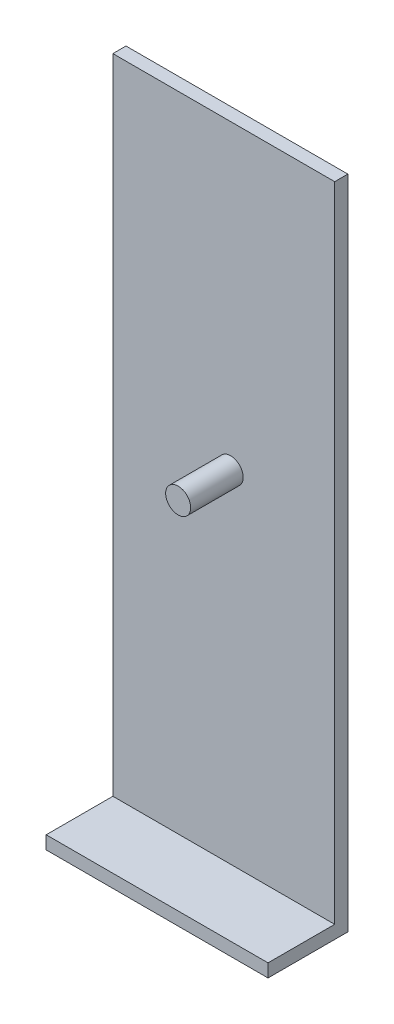
ISO-10303-21;
HEADER;
FILE_DESCRIPTION(('STEP AP214'),'2;1');
FILE_NAME('part.step','',(''),(''),'','','');
FILE_SCHEMA(('AUTOMOTIVE_DESIGN { 1 0 10303 214 1 1 1 1 }'));
ENDSEC;
DATA;
#1=APPLICATION_CONTEXT('core data for automotive mechanical design processes');
#2=APPLICATION_PROTOCOL_DEFINITION('international standard','automotive_design',2000,#1);
#3=PRODUCT_CONTEXT('',#1,'mechanical');
#4=PRODUCT('Part','Part','',(#3));
#5=PRODUCT_RELATED_PRODUCT_CATEGORY('part','',(#4));
#6=PRODUCT_DEFINITION_FORMATION('','',#4);
#7=PRODUCT_DEFINITION_CONTEXT('part definition',#1,'design');
#8=PRODUCT_DEFINITION('design','',#6,#7);
#9=PRODUCT_DEFINITION_SHAPE('','',#8);
#10=(LENGTH_UNIT() NAMED_UNIT(*) SI_UNIT(.MILLI.,.METRE.));
#11=(NAMED_UNIT(*) PLANE_ANGLE_UNIT() SI_UNIT($,.RADIAN.));
#12=(NAMED_UNIT(*) SI_UNIT($,.STERADIAN.) SOLID_ANGLE_UNIT());
#13=UNCERTAINTY_MEASURE_WITH_UNIT(LENGTH_MEASURE(1.E-05),#10,'distance_accuracy_value','');
#14=(GEOMETRIC_REPRESENTATION_CONTEXT(3) GLOBAL_UNCERTAINTY_ASSIGNED_CONTEXT((#13)) GLOBAL_UNIT_ASSIGNED_CONTEXT((#10,
#11,#12)) REPRESENTATION_CONTEXT('',''));
#15=CARTESIAN_POINT('',(0.,0.,0.));
#16=DIRECTION('',(0.,0.,1.));
#17=DIRECTION('',(1.,0.,0.));
#18=AXIS2_PLACEMENT_3D('',#15,#16,#17);
#19=CARTESIAN_POINT('',(0.,0.,5.));
#20=DIRECTION('',(0.,0.,-1.));
#21=DIRECTION('',(-1.,0.,0.));
#22=AXIS2_PLACEMENT_3D('',#19,#20,#21);
#23=PLANE('',#22);
#24=CARTESIAN_POINT('',(2.625,10.,5.));
#25=DIRECTION('',(0.,0.,-1.));
#26=DIRECTION('',(-1.,0.,0.));
#27=AXIS2_PLACEMENT_3D('',#24,#25,#26);
#28=CIRCLE('',#27,4.76250000000001);
#29=CARTESIAN_POINT('',(-2.13750000000001,10.,5.));
#30=VERTEX_POINT('',#29);
#31=EDGE_CURVE('E11',#30,#30,#28,.F.);
#32=ORIENTED_EDGE('',*,*,#31,.F.);
#33=EDGE_LOOP('',(#32));
#34=FACE_BOUND('',#33,.T.);
#35=DIRECTION('',(-1.,0.,0.));
#36=VECTOR('',#35,1.);
#37=CARTESIAN_POINT('',(-42.25,-120.,5.));
#38=LINE('',#37,#36);
#39=CARTESIAN_POINT('',(42.25,-120.,5.));
#40=VERTEX_POINT('',#39);
#41=CARTESIAN_POINT('',(-42.25,-120.,5.));
#42=VERTEX_POINT('',#41);
#43=EDGE_CURVE('E55',#40,#42,#38,.T.);
#44=ORIENTED_EDGE('',*,*,#43,.F.);
#45=DIRECTION('',(0.,1.,0.));
#46=VECTOR('',#45,1.);
#47=CARTESIAN_POINT('',(42.25,-125.,5.));
#48=LINE('',#47,#46);
#49=CARTESIAN_POINT('',(42.25,125.,5.));
#50=VERTEX_POINT('',#49);
#51=EDGE_CURVE('E60',#40,#50,#48,.T.);
#52=ORIENTED_EDGE('',*,*,#51,.T.);
#53=DIRECTION('',(1.,0.,0.));
#54=VECTOR('',#53,1.);
#55=CARTESIAN_POINT('',(-42.25,125.,5.));
#56=LINE('',#55,#54);
#57=CARTESIAN_POINT('',(-42.25,125.,5.));
#58=VERTEX_POINT('',#57);
#59=EDGE_CURVE('E130',#58,#50,#56,.T.);
#60=ORIENTED_EDGE('',*,*,#59,.F.);
#61=DIRECTION('',(0.,1.,0.));
#62=VECTOR('',#61,1.);
#63=CARTESIAN_POINT('',(-42.25,-125.,5.));
#64=LINE('',#63,#62);
#65=EDGE_CURVE('E104',#42,#58,#64,.T.);
#66=ORIENTED_EDGE('',*,*,#65,.F.);
#67=EDGE_LOOP('',(#44,#52,#60,#66));
#68=FACE_BOUND('',#67,.T.);
#69=ADVANCED_FACE('F39',(#34,#68),#23,.F.);
#70=CARTESIAN_POINT('',(-42.25,-125.,5.));
#71=DIRECTION('',(-1.,0.,0.));
#72=DIRECTION('',(0.,0.,1.));
#73=AXIS2_PLACEMENT_3D('',#70,#71,#72);
#74=PLANE('',#73);
#75=DIRECTION('',(0.,1.,0.));
#76=VECTOR('',#75,1.);
#77=CARTESIAN_POINT('',(-42.25,-125.,0.));
#78=LINE('',#77,#76);
#79=CARTESIAN_POINT('',(-42.25,-125.,0.));
#80=VERTEX_POINT('',#79);
#81=CARTESIAN_POINT('',(-42.25,125.,0.));
#82=VERTEX_POINT('',#81);
#83=EDGE_CURVE('E100',#80,#82,#78,.T.);
#84=ORIENTED_EDGE('',*,*,#83,.F.);
#85=DIRECTION('',(0.,0.,-1.));
#86=VECTOR('',#85,1.);
#87=CARTESIAN_POINT('',(-42.25,-125.,5.));
#88=LINE('',#87,#86);
#89=CARTESIAN_POINT('',(-42.25,-125.,30.4));
#90=VERTEX_POINT('',#89);
#91=EDGE_CURVE('E48',#90,#80,#88,.T.);
#92=ORIENTED_EDGE('',*,*,#91,.F.);
#93=DIRECTION('',(0.,-1.,0.));
#94=VECTOR('',#93,1.);
#95=CARTESIAN_POINT('',(-42.25,-120.,30.4));
#96=LINE('',#95,#94);
#97=CARTESIAN_POINT('',(-42.25,-120.,30.4));
#98=VERTEX_POINT('',#97);
#99=EDGE_CURVE('E143',#98,#90,#96,.T.);
#100=ORIENTED_EDGE('',*,*,#99,.F.);
#101=DIRECTION('',(0.,0.,-1.));
#102=VECTOR('',#101,1.);
#103=CARTESIAN_POINT('',(-42.25,-120.,30.4));
#104=LINE('',#103,#102);
#105=EDGE_CURVE('E117',#98,#42,#104,.T.);
#106=ORIENTED_EDGE('',*,*,#105,.T.);
#107=ORIENTED_EDGE('',*,*,#65,.T.);
#108=DIRECTION('',(0.,0.,-1.));
#109=VECTOR('',#108,1.);
#110=CARTESIAN_POINT('',(-42.25,125.,5.));
#111=LINE('',#110,#109);
#112=EDGE_CURVE('E107',#58,#82,#111,.T.);
#113=ORIENTED_EDGE('',*,*,#112,.T.);
#114=EDGE_LOOP('',(#84,#92,#100,#106,#107,#113));
#115=FACE_BOUND('',#114,.T.);
#116=ADVANCED_FACE('F41',(#115),#74,.T.);
#117=CARTESIAN_POINT('',(-42.25,-125.,5.));
#118=DIRECTION('',(0.,1.,0.));
#119=DIRECTION('',(0.,0.,1.));
#120=AXIS2_PLACEMENT_3D('',#117,#118,#119);
#121=PLANE('',#120);
#122=DIRECTION('',(1.,0.,0.));
#123=VECTOR('',#122,1.);
#124=CARTESIAN_POINT('',(-42.25,-125.,0.));
#125=LINE('',#124,#123);
#126=CARTESIAN_POINT('',(42.25,-125.,0.));
#127=VERTEX_POINT('',#126);
#128=EDGE_CURVE('E83',#80,#127,#125,.T.);
#129=ORIENTED_EDGE('',*,*,#128,.T.);
#130=DIRECTION('',(0.,0.,-1.));
#131=VECTOR('',#130,1.);
#132=CARTESIAN_POINT('',(42.25,-125.,5.));
#133=LINE('',#132,#131);
#134=CARTESIAN_POINT('',(42.25,-125.,30.4));
#135=VERTEX_POINT('',#134);
#136=EDGE_CURVE('E93',#135,#127,#133,.T.);
#137=ORIENTED_EDGE('',*,*,#136,.F.);
#138=DIRECTION('',(1.,0.,0.));
#139=VECTOR('',#138,1.);
#140=CARTESIAN_POINT('',(-42.25,-125.,30.4));
#141=LINE('',#140,#139);
#142=EDGE_CURVE('E87',#90,#135,#141,.T.);
#143=ORIENTED_EDGE('',*,*,#142,.F.);
#144=ORIENTED_EDGE('',*,*,#91,.T.);
#145=EDGE_LOOP('',(#129,#137,#143,#144));
#146=FACE_BOUND('',#145,.T.);
#147=ADVANCED_FACE('F81',(#146),#121,.F.);
#148=CARTESIAN_POINT('',(42.25,-125.,5.));
#149=DIRECTION('',(-1.,0.,0.));
#150=DIRECTION('',(0.,0.,1.));
#151=AXIS2_PLACEMENT_3D('',#148,#149,#150);
#152=PLANE('',#151);
#153=DIRECTION('',(0.,1.,0.));
#154=VECTOR('',#153,1.);
#155=CARTESIAN_POINT('',(42.25,-125.,0.));
#156=LINE('',#155,#154);
#157=CARTESIAN_POINT('',(42.25,125.,0.));
#158=VERTEX_POINT('',#157);
#159=EDGE_CURVE('E102',#127,#158,#156,.T.);
#160=ORIENTED_EDGE('',*,*,#159,.T.);
#161=DIRECTION('',(0.,0.,-1.));
#162=VECTOR('',#161,1.);
#163=CARTESIAN_POINT('',(42.25,125.,5.));
#164=LINE('',#163,#162);
#165=EDGE_CURVE('E126',#50,#158,#164,.T.);
#166=ORIENTED_EDGE('',*,*,#165,.F.);
#167=ORIENTED_EDGE('',*,*,#51,.F.);
#168=DIRECTION('',(0.,0.,-1.));
#169=VECTOR('',#168,1.);
#170=CARTESIAN_POINT('',(42.25,-120.,30.4));
#171=LINE('',#170,#169);
#172=CARTESIAN_POINT('',(42.25,-120.,30.4));
#173=VERTEX_POINT('',#172);
#174=EDGE_CURVE('E111',#173,#40,#171,.T.);
#175=ORIENTED_EDGE('',*,*,#174,.F.);
#176=DIRECTION('',(0.,1.,0.));
#177=VECTOR('',#176,1.);
#178=CARTESIAN_POINT('',(42.25,-120.,30.4));
#179=LINE('',#178,#177);
#180=EDGE_CURVE('E148',#135,#173,#179,.T.);
#181=ORIENTED_EDGE('',*,*,#180,.F.);
#182=ORIENTED_EDGE('',*,*,#136,.T.);
#183=EDGE_LOOP('',(#160,#166,#167,#175,#181,#182));
#184=FACE_BOUND('',#183,.T.);
#185=ADVANCED_FACE('F183',(#184),#152,.F.);
#186=CARTESIAN_POINT('',(-42.25,125.,5.));
#187=DIRECTION('',(0.,1.,0.));
#188=DIRECTION('',(0.,0.,1.));
#189=AXIS2_PLACEMENT_3D('',#186,#187,#188);
#190=PLANE('',#189);
#191=DIRECTION('',(1.,0.,0.));
#192=VECTOR('',#191,1.);
#193=CARTESIAN_POINT('',(-42.25,125.,0.));
#194=LINE('',#193,#192);
#195=EDGE_CURVE('E110',#82,#158,#194,.T.);
#196=ORIENTED_EDGE('',*,*,#195,.F.);
#197=ORIENTED_EDGE('',*,*,#112,.F.);
#198=ORIENTED_EDGE('',*,*,#59,.T.);
#199=ORIENTED_EDGE('',*,*,#165,.T.);
#200=EDGE_LOOP('',(#196,#197,#198,#199));
#201=FACE_BOUND('',#200,.T.);
#202=ADVANCED_FACE('F180',(#201),#190,.T.);
#203=CARTESIAN_POINT('',(0.,0.,0.));
#204=DIRECTION('',(0.,0.,-1.));
#205=DIRECTION('',(-1.,0.,0.));
#206=AXIS2_PLACEMENT_3D('',#203,#204,#205);
#207=PLANE('',#206);
#208=ORIENTED_EDGE('',*,*,#83,.T.);
#209=ORIENTED_EDGE('',*,*,#195,.T.);
#210=ORIENTED_EDGE('',*,*,#159,.F.);
#211=ORIENTED_EDGE('',*,*,#128,.F.);
#212=EDGE_LOOP('',(#208,#209,#210,#211));
#213=FACE_BOUND('',#212,.T.);
#214=ADVANCED_FACE('F98',(#213),#207,.T.);
#215=CARTESIAN_POINT('',(-42.25,-120.,30.4));
#216=DIRECTION('',(0.,-1.,0.));
#217=DIRECTION('',(0.,0.,-1.));
#218=AXIS2_PLACEMENT_3D('',#215,#216,#217);
#219=PLANE('',#218);
#220=ORIENTED_EDGE('',*,*,#43,.T.);
#221=ORIENTED_EDGE('',*,*,#105,.F.);
#222=DIRECTION('',(-1.,0.,0.));
#223=VECTOR('',#222,1.);
#224=CARTESIAN_POINT('',(-42.25,-120.,30.4));
#225=LINE('',#224,#223);
#226=EDGE_CURVE('E140',#173,#98,#225,.T.);
#227=ORIENTED_EDGE('',*,*,#226,.F.);
#228=ORIENTED_EDGE('',*,*,#174,.T.);
#229=EDGE_LOOP('',(#220,#221,#227,#228));
#230=FACE_BOUND('',#229,.T.);
#231=ADVANCED_FACE('F176',(#230),#219,.F.);
#232=CARTESIAN_POINT('',(0.,0.,30.4));
#233=DIRECTION('',(0.,0.,1.));
#234=DIRECTION('',(1.,0.,0.));
#235=AXIS2_PLACEMENT_3D('',#232,#233,#234);
#236=PLANE('',#235);
#237=ORIENTED_EDGE('',*,*,#99,.T.);
#238=ORIENTED_EDGE('',*,*,#142,.T.);
#239=ORIENTED_EDGE('',*,*,#180,.T.);
#240=ORIENTED_EDGE('',*,*,#226,.T.);
#241=EDGE_LOOP('',(#237,#238,#239,#240));
#242=FACE_BOUND('',#241,.T.);
#243=ADVANCED_FACE('F165',(#242),#236,.T.);
#244=CARTESIAN_POINT('',(2.625,10.,25.));
#245=DIRECTION('',(0.,0.,-1.));
#246=DIRECTION('',(-1.,0.,0.));
#247=AXIS2_PLACEMENT_3D('',#244,#245,#246);
#248=CYLINDRICAL_SURFACE('',#247,4.76250000000001);
#249=CARTESIAN_POINT('',(2.625,10.,25.));
#250=DIRECTION('',(0.,0.,1.));
#251=DIRECTION('',(1.,0.,0.));
#252=AXIS2_PLACEMENT_3D('',#249,#250,#251);
#253=CIRCLE('',#252,4.76250000000001);
#254=CARTESIAN_POINT('',(7.3875,10.,25.));
#255=VERTEX_POINT('',#254);
#256=EDGE_CURVE('E144',#255,#255,#253,.T.);
#257=ORIENTED_EDGE('',*,*,#256,.F.);
#258=EDGE_LOOP('',(#257));
#259=FACE_BOUND('',#258,.T.);
#260=ORIENTED_EDGE('',*,*,#31,.T.);
#261=EDGE_LOOP('',(#260));
#262=FACE_BOUND('',#261,.T.);
#263=ADVANCED_FACE('F162',(#259,#262),#248,.T.);
#264=CARTESIAN_POINT('',(2.625,10.,25.));
#265=DIRECTION('',(0.,0.,1.));
#266=DIRECTION('',(1.,0.,0.));
#267=AXIS2_PLACEMENT_3D('',#264,#265,#266);
#268=PLANE('',#267);
#269=ORIENTED_EDGE('',*,*,#256,.T.);
#270=EDGE_LOOP('',(#269));
#271=FACE_BOUND('',#270,.T.);
#272=ADVANCED_FACE('F160',(#271),#268,.T.);
#273=CLOSED_SHELL('',(#69,#116,#147,#185,#202,#214,#231,#243,#263,#272));
#274=MANIFOLD_SOLID_BREP('B2',#273);
#275=ADVANCED_BREP_SHAPE_REPRESENTATION('',(#18,#274),#14);
#276=SHAPE_DEFINITION_REPRESENTATION(#9,#275);
ENDSEC;
END-ISO-10303-21;
